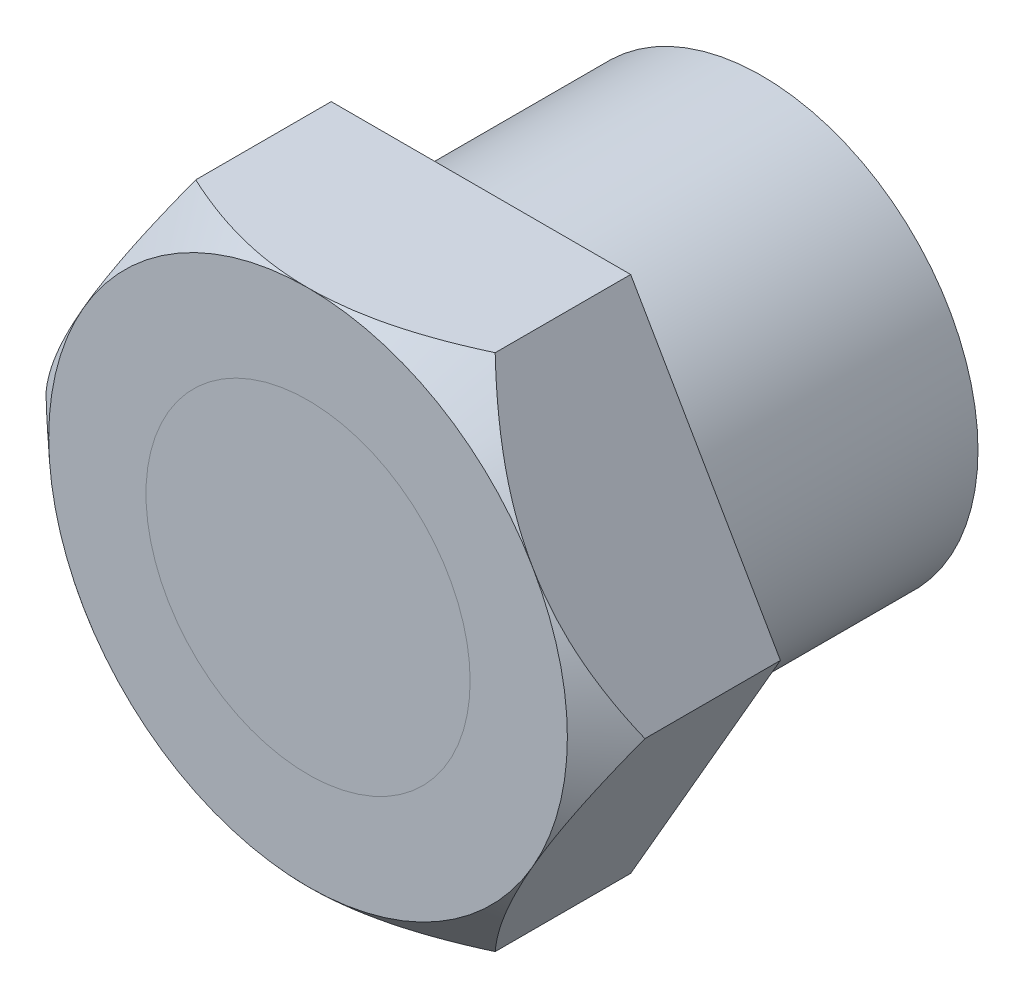
ISO-10303-21;
HEADER;
FILE_DESCRIPTION(('STEP AP214'),'2;1');
FILE_NAME('part.step','',(''),(''),'','','');
FILE_SCHEMA(('AUTOMOTIVE_DESIGN { 1 0 10303 214 1 1 1 1 }'));
ENDSEC;
DATA;
#1=APPLICATION_CONTEXT('core data for automotive mechanical design processes');
#2=APPLICATION_PROTOCOL_DEFINITION('international standard','automotive_design',2000,#1);
#3=PRODUCT_CONTEXT('',#1,'mechanical');
#4=PRODUCT('Part','Part','',(#3));
#5=PRODUCT_RELATED_PRODUCT_CATEGORY('part','',(#4));
#6=PRODUCT_DEFINITION_FORMATION('','',#4);
#7=PRODUCT_DEFINITION_CONTEXT('part definition',#1,'design');
#8=PRODUCT_DEFINITION('design','',#6,#7);
#9=PRODUCT_DEFINITION_SHAPE('','',#8);
#10=(LENGTH_UNIT() NAMED_UNIT(*) SI_UNIT(.MILLI.,.METRE.));
#11=(NAMED_UNIT(*) PLANE_ANGLE_UNIT() SI_UNIT($,.RADIAN.));
#12=(NAMED_UNIT(*) SI_UNIT($,.STERADIAN.) SOLID_ANGLE_UNIT());
#13=UNCERTAINTY_MEASURE_WITH_UNIT(LENGTH_MEASURE(1.E-05),#10,'distance_accuracy_value','');
#14=(GEOMETRIC_REPRESENTATION_CONTEXT(3) GLOBAL_UNCERTAINTY_ASSIGNED_CONTEXT((#13)) GLOBAL_UNIT_ASSIGNED_CONTEXT((#10,
#11,#12)) REPRESENTATION_CONTEXT('',''));
#15=CARTESIAN_POINT('',(0.,0.,0.));
#16=DIRECTION('',(0.,0.,1.));
#17=DIRECTION('',(1.,0.,0.));
#18=AXIS2_PLACEMENT_3D('',#15,#16,#17);
#19=CARTESIAN_POINT('',(0.,0.,18.));
#20=DIRECTION('',(0.,0.,1.));
#21=DIRECTION('',(1.,0.,0.));
#22=AXIS2_PLACEMENT_3D('',#19,#20,#21);
#23=CYLINDRICAL_SURFACE('',#22,7.5);
#24=CARTESIAN_POINT('',(0.,0.,18.));
#25=DIRECTION('',(0.,0.,1.));
#26=DIRECTION('',(1.,0.,0.));
#27=AXIS2_PLACEMENT_3D('',#24,#25,#26);
#28=CIRCLE('',#27,7.5);
#29=CARTESIAN_POINT('',(7.5,0.,18.));
#30=VERTEX_POINT('',#29);
#31=EDGE_CURVE('E13',#30,#30,#28,.T.);
#32=ORIENTED_EDGE('',*,*,#31,.T.);
#33=EDGE_LOOP('',(#32));
#34=FACE_BOUND('',#33,.T.);
#35=CARTESIAN_POINT('',(0.,0.,21.));
#36=DIRECTION('',(0.,0.,1.));
#37=DIRECTION('',(1.,0.,0.));
#38=AXIS2_PLACEMENT_3D('',#35,#36,#37);
#39=CIRCLE('',#38,7.5);
#40=CARTESIAN_POINT('',(7.5,0.,21.));
#41=VERTEX_POINT('',#40);
#42=EDGE_CURVE('E63',#41,#41,#39,.T.);
#43=ORIENTED_EDGE('',*,*,#42,.F.);
#44=EDGE_LOOP('',(#43));
#45=FACE_BOUND('',#44,.T.);
#46=ADVANCED_FACE('F60',(#34,#45),#23,.T.);
#47=CARTESIAN_POINT('',(0.,0.,18.));
#48=DIRECTION('',(0.,0.,1.));
#49=DIRECTION('',(1.,0.,0.));
#50=AXIS2_PLACEMENT_3D('',#47,#48,#49);
#51=PLANE('',#50);
#52=ORIENTED_EDGE('',*,*,#31,.F.);
#53=EDGE_LOOP('',(#52));
#54=FACE_BOUND('',#53,.T.);
#55=ADVANCED_FACE('F75',(#54),#51,.F.);
#56=CARTESIAN_POINT('',(0.,0.,21.));
#57=DIRECTION('',(0.,0.,1.));
#58=DIRECTION('',(1.,0.,0.));
#59=AXIS2_PLACEMENT_3D('',#56,#57,#58);
#60=PLANE('',#59);
#61=ORIENTED_EDGE('',*,*,#42,.T.);
#62=EDGE_LOOP('',(#61));
#63=FACE_BOUND('',#62,.T.);
#64=ADVANCED_FACE('F72',(#63),#60,.T.);
#65=CLOSED_SHELL('',(#46,#55,#64));
#66=MANIFOLD_SOLID_BREP('B2',#65);
#67=CARTESIAN_POINT('',(0.,0.,21.));
#68=DIRECTION('',(0.,0.,1.));
#69=DIRECTION('',(1.,0.,0.));
#70=AXIS2_PLACEMENT_3D('',#67,#68,#69);
#71=PLANE('',#70);
#72=CARTESIAN_POINT('',(0.,0.,21.));
#73=DIRECTION('',(0.,0.,1.));
#74=DIRECTION('',(1.,0.,0.));
#75=AXIS2_PLACEMENT_3D('',#72,#73,#74);
#76=CIRCLE('',#75,7.5);
#77=CARTESIAN_POINT('',(7.5,0.,21.));
#78=VERTEX_POINT('',#77);
#79=EDGE_CURVE('E209',#78,#78,#76,.T.);
#80=ORIENTED_EDGE('',*,*,#79,.F.);
#81=EDGE_LOOP('',(#80));
#82=FACE_BOUND('',#81,.T.);
#83=CARTESIAN_POINT('',(0.,0.,21.));
#84=DIRECTION('',(0.,0.,1.));
#85=DIRECTION('',(1.,0.,0.));
#86=AXIS2_PLACEMENT_3D('',#83,#84,#85);
#87=CIRCLE('',#86,12.);
#88=CARTESIAN_POINT('',(10.3923048454133,-6.,21.));
#89=VERTEX_POINT('',#88);
#90=CARTESIAN_POINT('',(10.3923048454133,6.,21.));
#91=VERTEX_POINT('',#90);
#92=EDGE_CURVE('E196',#89,#91,#87,.T.);
#93=ORIENTED_EDGE('',*,*,#92,.T.);
#94=CARTESIAN_POINT('',(0.,12.,21.));
#95=VERTEX_POINT('',#94);
#96=EDGE_CURVE('E351',#91,#95,#87,.T.);
#97=ORIENTED_EDGE('',*,*,#96,.T.);
#98=CARTESIAN_POINT('',(-10.3923048454133,6.,21.));
#99=VERTEX_POINT('',#98);
#100=EDGE_CURVE('E134',#95,#99,#87,.T.);
#101=ORIENTED_EDGE('',*,*,#100,.T.);
#102=CARTESIAN_POINT('',(-10.3923048454133,-6.,21.));
#103=VERTEX_POINT('',#102);
#104=EDGE_CURVE('E142',#99,#103,#87,.T.);
#105=ORIENTED_EDGE('',*,*,#104,.T.);
#106=CARTESIAN_POINT('',(0.,-12.,21.));
#107=VERTEX_POINT('',#106);
#108=EDGE_CURVE('E354',#103,#107,#87,.T.);
#109=ORIENTED_EDGE('',*,*,#108,.T.);
#110=EDGE_CURVE('E353',#107,#89,#87,.T.);
#111=ORIENTED_EDGE('',*,*,#110,.T.);
#112=EDGE_LOOP('',(#93,#97,#101,#105,#109,#111));
#113=FACE_BOUND('',#112,.T.);
#114=ADVANCED_FACE('F113',(#82,#113),#71,.T.);
#115=CARTESIAN_POINT('',(13.856406460551,0.,21.));
#116=DIRECTION('',(-0.866025403784439,-0.5,0.));
#117=DIRECTION('',(0.5,-0.866025403784439,0.));
#118=AXIS2_PLACEMENT_3D('',#115,#116,#117);
#119=PLANE('',#118);
#120=CARTESIAN_POINT('',(13.8565219306049,-0.000199999999997675,19.2687652906196));
#121=CARTESIAN_POINT('',(13.7298535468322,0.219196076406888,19.3868680077246));
#122=CARTESIAN_POINT('',(13.6022405840424,0.440228211663259,19.5010328960309));
#123=CARTESIAN_POINT('',(13.3449874157697,0.885803769519554,19.7202266885841));
#124=CARTESIAN_POINT('',(13.2153461129664,1.11034909273436,19.8252504306312));
#125=CARTESIAN_POINT('',(12.9533317516002,1.56417127893333,20.0253070055428));
#126=CARTESIAN_POINT('',(12.8209476923777,1.79346719561892,20.1202825778015));
#127=CARTESIAN_POINT('',(12.5541630837989,2.25555169235469,20.2980559822874));
#128=CARTESIAN_POINT('',(12.4197628544586,2.48833971812109,20.3808557250454));
#129=CARTESIAN_POINT('',(12.151395636061,2.95316537547157,20.5313827715993));
#130=CARTESIAN_POINT('',(12.0174623191401,3.18514468520479,20.5993487527394));
#131=CARTESIAN_POINT('',(11.7479403692396,3.65197039618762,20.7205259668705));
#132=CARTESIAN_POINT('',(11.6123519189156,3.88681648106823,20.773738812878));
#133=CARTESIAN_POINT('',(11.3401274148654,4.3583231531485,20.8639847638536));
#134=CARTESIAN_POINT('',(11.203494264481,4.59497871161238,20.9010526460722));
#135=CARTESIAN_POINT('',(10.9293403726877,5.06982718129112,20.9581367840253));
#136=CARTESIAN_POINT('',(10.7918196991394,5.30801997496793,20.9781543282349));
#137=CARTESIAN_POINT('',(10.5340151153218,5.7545506125642,20.9991179727742));
#138=CARTESIAN_POINT('',(10.4137732106192,5.96281570070792,21.002173494282));
#139=CARTESIAN_POINT('',(10.1733955843862,6.37916196234616,20.9947973649588));
#140=CARTESIAN_POINT('',(10.053259859518,6.5872431416221,20.9843661543718));
#141=CARTESIAN_POINT('',(9.81338228458328,7.00272328900542,20.9502462596401));
#142=CARTESIAN_POINT('',(9.69364075382888,7.21012170404811,20.9265486621989));
#143=CARTESIAN_POINT('',(9.45496344405281,7.62352293119413,20.866418130283));
#144=CARTESIAN_POINT('',(9.33602767716845,7.82952572227501,20.8299850044043));
#145=CARTESIAN_POINT('',(9.0991635038578,8.23978650494185,20.7451096847123));
#146=CARTESIAN_POINT('',(8.98123574219604,8.44404337976288,20.6966603242633));
#147=CARTESIAN_POINT('',(8.7466504656097,8.85035699751804,20.5886664235882));
#148=CARTESIAN_POINT('',(8.62999316321666,9.05241337233669,20.5291200562592));
#149=CARTESIAN_POINT('',(8.28224284580934,9.65473459043438,20.3353579119844));
#150=CARTESIAN_POINT('',(8.05323546599603,10.0513870075793,20.1859683094035));
#151=CARTESIAN_POINT('',(7.6744163249995,10.7075210066649,19.9082662379181));
#152=CARTESIAN_POINT('',(7.52293912428992,10.9698872144822,19.7887563472591));
#153=CARTESIAN_POINT('',(7.22326061381493,11.4889456205614,19.5374819210416));
#154=CARTESIAN_POINT('',(7.07504852250161,11.7456564930121,19.405768969276));
#155=CARTESIAN_POINT('',(6.92808776022167,12.0002,19.2687652906196));
#156=B_SPLINE_CURVE_WITH_KNOTS('',3,(#120,#121,#122,#123,#124,#125,#126,#127,#128,#129,#130,
#131,#132,#133,#134,#135,#136,#137,#138,#139,#140,#141,#142,#143,#144,#145,#146,#147,#148,#149,
#150,#151,#152,#153,#154,#155),.UNSPECIFIED.,.F.,.F.,(4,2,2,2,2,2,2,2,2,2,2,2,2,2,2,2,2,4),(0.,
0.838578409162805,1.6776273497624,2.52122579459731,3.36469172733357,4.19337849948459,
5.02197463239258,5.84877698290693,6.67551684733856,7.39665658074843,8.1177727747686,
8.83937404809948,9.56098616693492,10.2830297037767,11.0051922290314,12.4486904571501,
13.425463991688,14.3982821681343),.UNSPECIFIED.);
#157=CARTESIAN_POINT('',(13.856406460551,0.,19.2688729695328));
#158=VERTEX_POINT('',#157);
#159=EDGE_CURVE('E193',#158,#91,#156,.T.);
#160=ORIENTED_EDGE('',*,*,#159,.F.);
#161=DIRECTION('',(0.,0.,-1.));
#162=VECTOR('',#161,1.);
#163=CARTESIAN_POINT('',(13.856406460551,0.,21.));
#164=LINE('',#163,#162);
#165=CARTESIAN_POINT('',(13.856406460551,0.,13.));
#166=VERTEX_POINT('',#165);
#167=EDGE_CURVE('E205',#158,#166,#164,.T.);
#168=ORIENTED_EDGE('',*,*,#167,.T.);
#169=DIRECTION('',(-0.5,0.866025403784439,0.));
#170=VECTOR('',#169,1.);
#171=CARTESIAN_POINT('',(13.856406460551,0.,13.));
#172=LINE('',#171,#170);
#173=CARTESIAN_POINT('',(6.92820323027551,12.,13.));
#174=VERTEX_POINT('',#173);
#175=EDGE_CURVE('E252',#166,#174,#172,.T.);
#176=ORIENTED_EDGE('',*,*,#175,.T.);
#177=DIRECTION('',(0.,0.,-1.));
#178=VECTOR('',#177,1.);
#179=CARTESIAN_POINT('',(6.92820323027551,12.,21.));
#180=LINE('',#179,#178);
#181=CARTESIAN_POINT('',(6.92820323027551,12.,19.2688729695328));
#182=VERTEX_POINT('',#181);
#183=EDGE_CURVE('E228',#182,#174,#180,.T.);
#184=ORIENTED_EDGE('',*,*,#183,.F.);
#185=EDGE_CURVE('E208',#91,#182,#156,.T.);
#186=ORIENTED_EDGE('',*,*,#185,.F.);
#187=EDGE_LOOP('',(#160,#168,#176,#184,#186));
#188=FACE_BOUND('',#187,.T.);
#189=ADVANCED_FACE('F203',(#188),#119,.F.);
#190=CARTESIAN_POINT('',(6.92820323027551,12.,21.));
#191=DIRECTION('',(0.,-1.,0.));
#192=DIRECTION('',(0.,0.,-1.));
#193=AXIS2_PLACEMENT_3D('',#190,#191,#192);
#194=PLANE('',#193);
#195=CARTESIAN_POINT('',(20.9284032302755,12.,9.69359402309739));
#196=CARTESIAN_POINT('',(20.5961115460008,12.,9.96239392915399));
#197=CARTESIAN_POINT('',(20.2630559804058,12.,10.2302535766126));
#198=CARTESIAN_POINT('',(19.5951954040262,12.,10.7637960719106));
#199=CARTESIAN_POINT('',(19.2603903583496,12.,11.0294788760609));
#200=CARTESIAN_POINT('',(18.5886148407881,12.,11.5585240963392));
#201=CARTESIAN_POINT('',(18.2516431581626,12.,11.821884976426));
#202=CARTESIAN_POINT('',(17.5754801520445,12.,12.3457410933049));
#203=CARTESIAN_POINT('',(17.2362888370438,12.,12.6062363410501));
#204=CARTESIAN_POINT('',(16.5409377948354,12.,13.1348934115765));
#205=CARTESIAN_POINT('',(16.184668726395,12.,13.4029115798384));
#206=CARTESIAN_POINT('',(15.4689875048341,12.,13.9347168007166));
#207=CARTESIAN_POINT('',(15.1095753794347,12.,14.1985038905922));
#208=CARTESIAN_POINT('',(14.3872367228909,12.,14.720994251888));
#209=CARTESIAN_POINT('',(14.0243113024537,12.,14.9796990564253));
#210=CARTESIAN_POINT('',(13.2942712257131,12.,15.4911401735357));
#211=CARTESIAN_POINT('',(12.9271565716275,12.,15.7438764892684));
#212=CARTESIAN_POINT('',(12.1872161218997,12.,16.2427352918662));
#213=CARTESIAN_POINT('',(11.8143791043053,12.,16.4888411750683));
#214=CARTESIAN_POINT('',(11.0630280534424,12.,16.9722713284048));
#215=CARTESIAN_POINT('',(10.6845139265705,12.,17.2095954535226));
#216=CARTESIAN_POINT('',(9.92041477173562,12.,17.6737491871757));
#217=CARTESIAN_POINT('',(9.53482130896823,12.,17.90056496624));
#218=CARTESIAN_POINT('',(8.75602168983686,12.,18.3407787062768));
#219=CARTESIAN_POINT('',(8.36281573513831,12.,18.5541770220619));
#220=CARTESIAN_POINT('',(7.57496809999253,12.,18.9604769232341));
#221=CARTESIAN_POINT('',(7.18048374047764,12.,19.1536816251151));
#222=CARTESIAN_POINT('',(6.38211904633376,12.,19.5199574784065));
#223=CARTESIAN_POINT('',(5.97823733514981,12.,19.6930256575877));
#224=CARTESIAN_POINT('',(5.16151587272158,12.,20.0136480238708));
#225=CARTESIAN_POINT('',(4.74870036434969,12.,20.1612633911765));
#226=CARTESIAN_POINT('',(3.91335709466702,12.,20.425683616891));
#227=CARTESIAN_POINT('',(3.49083492565155,12.,20.542505755095));
#228=CARTESIAN_POINT('',(2.85044334445482,12.,20.6902590635561));
#229=CARTESIAN_POINT('',(2.63570358440288,12.,20.7349549222836));
#230=CARTESIAN_POINT('',(2.20441212230094,12.,20.8144606857338));
#231=CARTESIAN_POINT('',(1.98786066773702,12.,20.8492719187553));
#232=CARTESIAN_POINT('',(1.55333063804168,12.,20.9084195363158));
#233=CARTESIAN_POINT('',(1.33535208477349,12.,20.9327560809484));
#234=CARTESIAN_POINT('',(0.898443369969175,12.,20.9705133124553));
#235=CARTESIAN_POINT('',(0.679513198166485,12.,20.983933881267));
#236=CARTESIAN_POINT('',(0.241682864132701,12.,20.9995860580908));
#237=CARTESIAN_POINT('',(0.0227834920595544,12.,21.0018396513316));
#238=CARTESIAN_POINT('',(-0.414842670827201,12.,20.9951743548103));
#239=CARTESIAN_POINT('',(-0.633569462148983,12.,20.9862554980697));
#240=CARTESIAN_POINT('',(-1.07030719133705,12.,20.9574138569585));
#241=CARTESIAN_POINT('',(-1.28831809132203,12.,20.9374904994323));
#242=CARTESIAN_POINT('',(-1.72311616367707,12.,20.8870156161981));
#243=CARTESIAN_POINT('',(-1.93990316590208,12.,20.8564626480297));
#244=CARTESIAN_POINT('',(-2.58126666821559,12.,20.7506900597248));
#245=CARTESIAN_POINT('',(-3.00349910407713,12.,20.6608859275909));
#246=CARTESIAN_POINT('',(-3.83908124539416,12.,20.4472752374638));
#247=CARTESIAN_POINT('',(-4.25243015253451,12.,20.3234656372437));
#248=CARTESIAN_POINT('',(-5.07458075569307,12.,20.0458894741855));
#249=CARTESIAN_POINT('',(-5.48326239510589,12.,19.8917702737064));
#250=CARTESIAN_POINT('',(-6.08889663483739,12.,19.6430235284429));
#251=CARTESIAN_POINT('',(-6.28953512992941,12.,19.5571839027856));
#252=CARTESIAN_POINT('',(-6.68847574237759,12.,19.3802296034082));
#253=CARTESIAN_POINT('',(-6.88677786853252,12.,19.2891149495615));
#254=CARTESIAN_POINT('',(-7.4124488125856,12.,19.0399223033906));
#255=CARTESIAN_POINT('',(-7.73783313867491,12.,18.8776550615308));
#256=CARTESIAN_POINT('',(-8.38295561387836,12.,18.5422164939008));
#257=CARTESIAN_POINT('',(-8.70269292898019,12.,18.3690435744222));
#258=CARTESIAN_POINT('',(-9.337241570953,12.,18.0135063446248));
#259=CARTESIAN_POINT('',(-9.65204996156143,12.,17.8311368097286));
#260=CARTESIAN_POINT('',(-10.2770942456345,12.,17.4587779809308));
#261=CARTESIAN_POINT('',(-10.5873303432614,12.,17.2687890286698));
#262=CARTESIAN_POINT('',(-11.2048047944886,12.,16.8817242847492));
#263=CARTESIAN_POINT('',(-11.5120294378762,12.,16.6846266718658));
#264=CARTESIAN_POINT('',(-12.1228876969323,12.,16.2849325041117));
#265=CARTESIAN_POINT('',(-12.4265211951099,12.,16.0823357700376));
#266=CARTESIAN_POINT('',(-13.0305076248845,12.,15.6725188154481));
#267=CARTESIAN_POINT('',(-13.3308615576271,12.,15.465300068197));
#268=CARTESIAN_POINT('',(-13.9287509845576,12.,15.0468320024675));
#269=CARTESIAN_POINT('',(-14.2262864316245,12.,14.8355826167803));
#270=CARTESIAN_POINT('',(-15.0717040210684,12.,14.2278583798228));
#271=CARTESIAN_POINT('',(-15.616549123649,12.,13.8271566929274));
#272=CARTESIAN_POINT('',(-16.6993618881535,12.,13.0165123416076));
#273=CARTESIAN_POINT('',(-17.2373289760055,12.,12.6065689136125));
#274=CARTESIAN_POINT('',(-18.303430196658,12.,11.7826408871182));
#275=CARTESIAN_POINT('',(-18.831608355231,12.,11.3687131828644));
#276=CARTESIAN_POINT('',(-19.6203938727146,12.,10.7435354390202));
#277=CARTESIAN_POINT('',(-19.8827194719618,12.,10.5344468288548));
#278=CARTESIAN_POINT('',(-20.4063223229468,12.,10.1149654229555));
#279=CARTESIAN_POINT('',(-20.667599583651,12.,9.90457263841559));
#280=CARTESIAN_POINT('',(-20.9284032302755,12.,9.69359402309739));
#281=B_SPLINE_CURVE_WITH_KNOTS('',3,(#195,#196,#197,#198,#199,#200,#201,#202,#203,#204,#205,
#206,#207,#208,#209,#210,#211,#212,#213,#214,#215,#216,#217,#218,#219,#220,#221,#222,#223,#224,
#225,#226,#227,#228,#229,#230,#231,#232,#233,#234,#235,#236,#237,#238,#239,#240,#241,#242,#243,
#244,#245,#246,#247,#248,#249,#250,#251,#252,#253,#254,#255,#256,#257,#258,#259,#260,#261,#262,
#263,#264,#265,#266,#267,#268,#269,#270,#271,#272,#273,#274,#275,#276,#277,#278,#279,#280),
.UNSPECIFIED.,.F.,.F.,(4,2,2,2,2,2,2,2,2,2,2,2,2,2,2,2,2,2,2,2,2,2,2,2,2,2,2,2,2,2,2,2,2,2,2,2,
2,2,2,2,2,2,4),(0.,1.28220344662964,2.5644325641958,3.84745437564654,5.13047128138408,
6.46792449974251,7.80536593390215,9.14239752176667,10.4794284017941,11.8195438866476,
13.1596814914783,14.5015353968087,15.8433538030859,17.1606707019033,18.4781817958172,
19.7924804889265,21.1060400781413,21.7638736632825,22.4216188066809,23.0793538968511,
23.7370961007135,24.393542844218,25.0499876475111,25.7064666441338,26.3630347611041,
27.656242399545,28.94956576976,30.2589363684924,30.9135670585536,31.5681952824888,
32.6587322758378,33.7494290070065,34.8407524985866,35.9320271118111,37.0269974220881,
38.1220034578042,39.2166653126068,40.3113454363444,42.3401845697403,44.3691919485964,
46.3822891867395,47.3886631063973,48.395028400121),.UNSPECIFIED.);
#282=EDGE_CURVE('E287',#182,#95,#281,.T.);
#283=ORIENTED_EDGE('',*,*,#282,.F.);
#284=ORIENTED_EDGE('',*,*,#183,.T.);
#285=DIRECTION('',(-1.,0.,0.));
#286=VECTOR('',#285,1.);
#287=CARTESIAN_POINT('',(6.92820323027551,12.,13.));
#288=LINE('',#287,#286);
#289=CARTESIAN_POINT('',(-6.92820323027551,12.,13.));
#290=VERTEX_POINT('',#289);
#291=EDGE_CURVE('E254',#174,#290,#288,.T.);
#292=ORIENTED_EDGE('',*,*,#291,.T.);
#293=DIRECTION('',(0.,0.,-1.));
#294=VECTOR('',#293,1.);
#295=CARTESIAN_POINT('',(-6.92820323027551,12.,21.));
#296=LINE('',#295,#294);
#297=CARTESIAN_POINT('',(-6.92820323027551,12.,19.2688729695328));
#298=VERTEX_POINT('',#297);
#299=EDGE_CURVE('E226',#298,#290,#296,.T.);
#300=ORIENTED_EDGE('',*,*,#299,.F.);
#301=EDGE_CURVE('E288',#95,#298,#281,.T.);
#302=ORIENTED_EDGE('',*,*,#301,.F.);
#303=EDGE_LOOP('',(#283,#284,#292,#300,#302));
#304=FACE_BOUND('',#303,.T.);
#305=ADVANCED_FACE('F284',(#304),#194,.F.);
#306=CARTESIAN_POINT('',(-6.92820323027551,12.,21.));
#307=DIRECTION('',(0.866025403784439,-0.5,0.));
#308=DIRECTION('',(0.5,0.866025403784439,0.));
#309=AXIS2_PLACEMENT_3D('',#306,#307,#308);
#310=PLANE('',#309);
#311=CARTESIAN_POINT('',(-6.92808776022167,12.0002,19.2687652906196));
#312=CARTESIAN_POINT('',(-7.05475614399434,11.7808039235931,19.3868680077245));
#313=CARTESIAN_POINT('',(-7.18236910678416,11.5597717883367,19.5010328960309));
#314=CARTESIAN_POINT('',(-7.43962227505681,11.1141962304804,19.7202266885841));
#315=CARTESIAN_POINT('',(-7.56926357786015,10.8896509072656,19.8252504306312));
#316=CARTESIAN_POINT('',(-7.83127793922635,10.4358287210667,20.0253070055428));
#317=CARTESIAN_POINT('',(-7.96366199844886,10.2065328043811,20.1202825778015));
#318=CARTESIAN_POINT('',(-8.23044660702761,9.74444830764531,20.2980559822874));
#319=CARTESIAN_POINT('',(-8.36484683636796,9.51166028187892,20.3808557250454));
#320=CARTESIAN_POINT('',(-8.63321405476551,9.04683462452843,20.5313827715993));
#321=CARTESIAN_POINT('',(-8.7671473716864,8.81485531479522,20.5993487527394));
#322=CARTESIAN_POINT('',(-9.03666932158698,8.34802960381238,20.7205259668705));
#323=CARTESIAN_POINT('',(-9.17225777191093,8.11318351893178,20.773738812878));
#324=CARTESIAN_POINT('',(-9.44448227596118,7.6416768468515,20.8639847638536));
#325=CARTESIAN_POINT('',(-9.58111542634552,7.40502128838762,20.9010526460722));
#326=CARTESIAN_POINT('',(-9.85526931813883,6.93017281870888,20.9581367840253));
#327=CARTESIAN_POINT('',(-9.99278999168716,6.69198002503207,20.9781543282349));
#328=CARTESIAN_POINT('',(-10.2505945755048,6.2454493874358,20.9991179727742));
#329=CARTESIAN_POINT('',(-10.3708364802074,6.03718429929208,21.002173494282));
#330=CARTESIAN_POINT('',(-10.6112141064403,5.62083803765385,20.9947973649588));
#331=CARTESIAN_POINT('',(-10.7313498313085,5.41275685837791,20.9843661543718));
#332=CARTESIAN_POINT('',(-10.9712274062433,4.99727671099458,20.95024625964));
#333=CARTESIAN_POINT('',(-11.0909689369977,4.78987829595189,20.9265486621989));
#334=CARTESIAN_POINT('',(-11.3296462467737,4.37647706880587,20.866418130283));
#335=CARTESIAN_POINT('',(-11.4485820136581,4.170474277725,20.8299850044043));
#336=CARTESIAN_POINT('',(-11.6854461869687,3.76021349505816,20.7451096847123));
#337=CARTESIAN_POINT('',(-11.8033739486305,3.55595662023712,20.6966603242633));
#338=CARTESIAN_POINT('',(-12.0379592252168,3.14964300248197,20.5886664235882));
#339=CARTESIAN_POINT('',(-12.1546165276099,2.94758662766331,20.5291200562592));
#340=CARTESIAN_POINT('',(-12.5023668450172,2.34526540956563,20.3353579119844));
#341=CARTESIAN_POINT('',(-12.7313742248305,1.94861299242075,20.1859683094035));
#342=CARTESIAN_POINT('',(-13.110193365827,1.29247899333515,19.9082662379181));
#343=CARTESIAN_POINT('',(-13.2616705665366,1.03011278551785,19.7887563472591));
#344=CARTESIAN_POINT('',(-13.5613490770116,0.511054379438619,19.5374819210416));
#345=CARTESIAN_POINT('',(-13.7095611683249,0.254343506987906,19.405768969276));
#346=CARTESIAN_POINT('',(-13.8565219306049,-0.00019999999999656,19.2687652906196));
#347=B_SPLINE_CURVE_WITH_KNOTS('',3,(#311,#312,#313,#314,#315,#316,#317,#318,#319,#320,#321,
#322,#323,#324,#325,#326,#327,#328,#329,#330,#331,#332,#333,#334,#335,#336,#337,#338,#339,#340,
#341,#342,#343,#344,#345,#346),.UNSPECIFIED.,.F.,.F.,(4,2,2,2,2,2,2,2,2,2,2,2,2,2,2,2,2,4),(0.,
0.838578409162805,1.6776273497624,2.52122579459731,3.36469172733357,4.19337849948459,
5.02197463239258,5.84877698290694,6.67551684733857,7.39665658074843,8.11777277476861,
8.83937404809949,9.56098616693492,10.2830297037767,11.0051922290314,12.4486904571501,
13.425463991688,14.3982821681343),.UNSPECIFIED.);
#348=EDGE_CURVE('E291',#298,#99,#347,.T.);
#349=ORIENTED_EDGE('',*,*,#348,.F.);
#350=ORIENTED_EDGE('',*,*,#299,.T.);
#351=DIRECTION('',(-0.5,-0.866025403784439,0.));
#352=VECTOR('',#351,1.);
#353=CARTESIAN_POINT('',(-6.92820323027551,12.,13.));
#354=LINE('',#353,#352);
#355=CARTESIAN_POINT('',(-13.856406460551,0.,13.));
#356=VERTEX_POINT('',#355);
#357=EDGE_CURVE('E265',#290,#356,#354,.T.);
#358=ORIENTED_EDGE('',*,*,#357,.T.);
#359=DIRECTION('',(0.,0.,-1.));
#360=VECTOR('',#359,1.);
#361=CARTESIAN_POINT('',(-13.856406460551,0.,21.));
#362=LINE('',#361,#360);
#363=CARTESIAN_POINT('',(-13.856406460551,0.,19.2688729695328));
#364=VERTEX_POINT('',#363);
#365=EDGE_CURVE('E224',#364,#356,#362,.T.);
#366=ORIENTED_EDGE('',*,*,#365,.F.);
#367=EDGE_CURVE('E298',#99,#364,#347,.T.);
#368=ORIENTED_EDGE('',*,*,#367,.F.);
#369=EDGE_LOOP('',(#349,#350,#358,#366,#368));
#370=FACE_BOUND('',#369,.T.);
#371=ADVANCED_FACE('F336',(#370),#310,.F.);
#372=CARTESIAN_POINT('',(-13.856406460551,0.,21.));
#373=DIRECTION('',(0.866025403784439,0.5,0.));
#374=DIRECTION('',(-0.5,0.866025403784438,0.));
#375=AXIS2_PLACEMENT_3D('',#372,#373,#374);
#376=PLANE('',#375);
#377=CARTESIAN_POINT('',(-13.8565219306049,0.00020000000000334,19.2687652906196));
#378=CARTESIAN_POINT('',(-13.7298535468322,-0.219196076406883,19.3868680077246));
#379=CARTESIAN_POINT('',(-13.6022405840424,-0.440228211663255,19.5010328960309));
#380=CARTESIAN_POINT('',(-13.3449874157697,-0.88580376951955,19.7202266885841));
#381=CARTESIAN_POINT('',(-13.2153461129664,-1.11034909273436,19.8252504306312));
#382=CARTESIAN_POINT('',(-12.9533317516002,-1.56417127893332,20.0253070055428));
#383=CARTESIAN_POINT('',(-12.8209476923777,-1.79346719561892,20.1202825778015));
#384=CARTESIAN_POINT('',(-12.5541630837989,-2.25555169235469,20.2980559822874));
#385=CARTESIAN_POINT('',(-12.4197628544586,-2.48833971812109,20.3808557250454));
#386=CARTESIAN_POINT('',(-12.151395636061,-2.95316537547157,20.5313827715993));
#387=CARTESIAN_POINT('',(-12.0174623191401,-3.18514468520479,20.5993487527394));
#388=CARTESIAN_POINT('',(-11.7479403692396,-3.65197039618762,20.7205259668705));
#389=CARTESIAN_POINT('',(-11.6123519189156,-3.88681648106823,20.773738812878));
#390=CARTESIAN_POINT('',(-11.3401274148654,-4.3583231531485,20.8639847638536));
#391=CARTESIAN_POINT('',(-11.203494264481,-4.59497871161238,20.9010526460722));
#392=CARTESIAN_POINT('',(-10.9293403726877,-5.06982718129113,20.9581367840253));
#393=CARTESIAN_POINT('',(-10.7918196991394,-5.30801997496793,20.978154328235));
#394=CARTESIAN_POINT('',(-10.5340151153218,-5.7545506125642,20.9991179727742));
#395=CARTESIAN_POINT('',(-10.4137732106192,-5.96281570070792,21.002173494282));
#396=CARTESIAN_POINT('',(-10.1733955843862,-6.37916196234616,20.9947973649588));
#397=CARTESIAN_POINT('',(-10.053259859518,-6.5872431416221,20.9843661543718));
#398=CARTESIAN_POINT('',(-9.81338228458327,-7.00272328900543,20.9502462596401));
#399=CARTESIAN_POINT('',(-9.69364075382888,-7.21012170404811,20.9265486621989));
#400=CARTESIAN_POINT('',(-9.4549634440528,-7.62352293119413,20.866418130283));
#401=CARTESIAN_POINT('',(-9.33602767716844,-7.82952572227501,20.8299850044043));
#402=CARTESIAN_POINT('',(-9.0991635038578,-8.23978650494185,20.7451096847123));
#403=CARTESIAN_POINT('',(-8.98123574219604,-8.44404337976288,20.6966603242633));
#404=CARTESIAN_POINT('',(-8.74665046560969,-8.85035699751804,20.5886664235882));
#405=CARTESIAN_POINT('',(-8.62999316321666,-9.05241337233669,20.5291200562592));
#406=CARTESIAN_POINT('',(-8.28224284580934,-9.65473459043438,20.3353579119844));
#407=CARTESIAN_POINT('',(-8.05323546599602,-10.0513870075793,20.1859683094035));
#408=CARTESIAN_POINT('',(-7.67441632499949,-10.7075210066648,19.9082662379181));
#409=CARTESIAN_POINT('',(-7.52293912428991,-10.9698872144822,19.7887563472591));
#410=CARTESIAN_POINT('',(-7.22326061381493,-11.4889456205614,19.5374819210416));
#411=CARTESIAN_POINT('',(-7.07504852250161,-11.7456564930121,19.405768969276));
#412=CARTESIAN_POINT('',(-6.92808776022167,-12.0002,19.2687652906196));
#413=B_SPLINE_CURVE_WITH_KNOTS('',3,(#377,#378,#379,#380,#381,#382,#383,#384,#385,#386,#387,
#388,#389,#390,#391,#392,#393,#394,#395,#396,#397,#398,#399,#400,#401,#402,#403,#404,#405,#406,
#407,#408,#409,#410,#411,#412),.UNSPECIFIED.,.F.,.F.,(4,2,2,2,2,2,2,2,2,2,2,2,2,2,2,2,2,4),(0.,
0.838578409162806,1.6776273497624,2.52122579459731,3.36469172733357,4.1933784994846,
5.02197463239259,5.84877698290694,6.67551684733858,7.39665658074844,8.11777277476862,
8.83937404809949,9.56098616693493,10.2830297037767,11.0051922290314,12.4486904571501,
13.425463991688,14.3982821681343),.UNSPECIFIED.);
#414=EDGE_CURVE('E331',#364,#103,#413,.T.);
#415=ORIENTED_EDGE('',*,*,#414,.F.);
#416=ORIENTED_EDGE('',*,*,#365,.T.);
#417=DIRECTION('',(0.5,-0.866025403784438,0.));
#418=VECTOR('',#417,1.);
#419=CARTESIAN_POINT('',(-13.856406460551,0.,13.));
#420=LINE('',#419,#418);
#421=CARTESIAN_POINT('',(-6.92820323027551,-12.,13.));
#422=VERTEX_POINT('',#421);
#423=EDGE_CURVE('E268',#356,#422,#420,.T.);
#424=ORIENTED_EDGE('',*,*,#423,.T.);
#425=DIRECTION('',(0.,0.,-1.));
#426=VECTOR('',#425,1.);
#427=CARTESIAN_POINT('',(-6.92820323027551,-12.,21.));
#428=LINE('',#427,#426);
#429=CARTESIAN_POINT('',(-6.92820323027551,-12.,19.2688729695328));
#430=VERTEX_POINT('',#429);
#431=EDGE_CURVE('E217',#430,#422,#428,.T.);
#432=ORIENTED_EDGE('',*,*,#431,.F.);
#433=EDGE_CURVE('E325',#103,#430,#413,.T.);
#434=ORIENTED_EDGE('',*,*,#433,.F.);
#435=EDGE_LOOP('',(#415,#416,#424,#432,#434));
#436=FACE_BOUND('',#435,.T.);
#437=ADVANCED_FACE('F333',(#436),#376,.F.);
#438=CARTESIAN_POINT('',(-6.92820323027551,-12.,21.));
#439=DIRECTION('',(0.,1.,0.));
#440=DIRECTION('',(0.,0.,1.));
#441=AXIS2_PLACEMENT_3D('',#438,#439,#440);
#442=PLANE('',#441);
#443=CARTESIAN_POINT('',(-20.9284032302755,-12.,9.6935940230974));
#444=CARTESIAN_POINT('',(-20.5961115460008,-12.,9.962393929154));
#445=CARTESIAN_POINT('',(-20.2630559804058,-12.,10.2302535766126));
#446=CARTESIAN_POINT('',(-19.5951954040262,-12.,10.7637960719106));
#447=CARTESIAN_POINT('',(-19.2603903583496,-12.,11.0294788760609));
#448=CARTESIAN_POINT('',(-18.5886148407881,-12.,11.5585240963392));
#449=CARTESIAN_POINT('',(-18.2516431581626,-12.,11.821884976426));
#450=CARTESIAN_POINT('',(-17.5754801520445,-12.,12.3457410933049));
#451=CARTESIAN_POINT('',(-17.2362888370438,-12.,12.6062363410501));
#452=CARTESIAN_POINT('',(-16.5409377948354,-12.,13.1348934115765));
#453=CARTESIAN_POINT('',(-16.184668726395,-12.,13.4029115798384));
#454=CARTESIAN_POINT('',(-15.4689875048341,-12.,13.9347168007166));
#455=CARTESIAN_POINT('',(-15.1095753794347,-12.,14.1985038905922));
#456=CARTESIAN_POINT('',(-14.3872367228909,-12.,14.720994251888));
#457=CARTESIAN_POINT('',(-14.0243113024537,-12.,14.9796990564253));
#458=CARTESIAN_POINT('',(-13.2942712257131,-12.,15.4911401735357));
#459=CARTESIAN_POINT('',(-12.9271565716275,-12.,15.7438764892684));
#460=CARTESIAN_POINT('',(-12.1872161218997,-12.,16.2427352918662));
#461=CARTESIAN_POINT('',(-11.8143791043053,-12.,16.4888411750683));
#462=CARTESIAN_POINT('',(-11.0630280534424,-12.,16.9722713284048));
#463=CARTESIAN_POINT('',(-10.6845139265705,-12.,17.2095954535226));
#464=CARTESIAN_POINT('',(-9.92041477173562,-12.,17.6737491871757));
#465=CARTESIAN_POINT('',(-9.53482130896822,-12.,17.9005649662401));
#466=CARTESIAN_POINT('',(-8.75602168983685,-12.,18.3407787062768));
#467=CARTESIAN_POINT('',(-8.36281573513831,-12.,18.5541770220619));
#468=CARTESIAN_POINT('',(-7.57496809999253,-12.,18.9604769232341));
#469=CARTESIAN_POINT('',(-7.18048374047763,-12.,19.1536816251151));
#470=CARTESIAN_POINT('',(-6.38211904633376,-12.,19.5199574784065));
#471=CARTESIAN_POINT('',(-5.97823733514981,-12.,19.6930256575877));
#472=CARTESIAN_POINT('',(-5.16151587272158,-12.,20.0136480238708));
#473=CARTESIAN_POINT('',(-4.74870036434969,-12.,20.1612633911765));
#474=CARTESIAN_POINT('',(-3.91335709466702,-12.,20.425683616891));
#475=CARTESIAN_POINT('',(-3.49083492565155,-12.,20.542505755095));
#476=CARTESIAN_POINT('',(-2.85044334445482,-12.,20.6902590635561));
#477=CARTESIAN_POINT('',(-2.63570358440288,-12.,20.7349549222836));
#478=CARTESIAN_POINT('',(-2.20441212230094,-12.,20.8144606857338));
#479=CARTESIAN_POINT('',(-1.98786066773703,-12.,20.8492719187553));
#480=CARTESIAN_POINT('',(-1.55333063804168,-12.,20.9084195363158));
#481=CARTESIAN_POINT('',(-1.33535208477349,-12.,20.9327560809484));
#482=CARTESIAN_POINT('',(-0.898443369969177,-12.,20.9705133124553));
#483=CARTESIAN_POINT('',(-0.679513198166487,-12.,20.983933881267));
#484=CARTESIAN_POINT('',(-0.241682864132703,-12.,20.9995860580908));
#485=CARTESIAN_POINT('',(-0.0227834920595577,-12.,21.0018396513316));
#486=CARTESIAN_POINT('',(0.414842670827196,-12.,20.9951743548103));
#487=CARTESIAN_POINT('',(0.633569462148978,-12.,20.9862554980697));
#488=CARTESIAN_POINT('',(1.07030719133704,-12.,20.9574138569585));
#489=CARTESIAN_POINT('',(1.28831809132202,-12.,20.9374904994323));
#490=CARTESIAN_POINT('',(1.72311616367706,-12.,20.8870156161981));
#491=CARTESIAN_POINT('',(1.93990316590208,-12.,20.8564626480297));
#492=CARTESIAN_POINT('',(2.58126666821559,-12.,20.7506900597248));
#493=CARTESIAN_POINT('',(3.00349910407712,-12.,20.6608859275909));
#494=CARTESIAN_POINT('',(3.83908124539415,-12.,20.4472752374638));
#495=CARTESIAN_POINT('',(4.2524301525345,-12.,20.3234656372437));
#496=CARTESIAN_POINT('',(5.07458075569307,-12.,20.0458894741855));
#497=CARTESIAN_POINT('',(5.48326239510588,-12.,19.8917702737064));
#498=CARTESIAN_POINT('',(6.08889663483738,-12.,19.6430235284429));
#499=CARTESIAN_POINT('',(6.2895351299294,-12.,19.5571839027856));
#500=CARTESIAN_POINT('',(6.68847574237759,-12.,19.3802296034082));
#501=CARTESIAN_POINT('',(6.88677786853251,-12.,19.2891149495615));
#502=CARTESIAN_POINT('',(7.41244881258559,-12.,19.0399223033906));
#503=CARTESIAN_POINT('',(7.7378331386749,-12.,18.8776550615308));
#504=CARTESIAN_POINT('',(8.38295561387835,-12.,18.5422164939008));
#505=CARTESIAN_POINT('',(8.70269292898018,-12.,18.3690435744222));
#506=CARTESIAN_POINT('',(9.33724157095299,-12.,18.0135063446248));
#507=CARTESIAN_POINT('',(9.65204996156142,-12.,17.8311368097286));
#508=CARTESIAN_POINT('',(10.2770942456345,-12.,17.4587779809308));
#509=CARTESIAN_POINT('',(10.5873303432614,-12.,17.2687890286698));
#510=CARTESIAN_POINT('',(11.2048047944886,-12.,16.8817242847492));
#511=CARTESIAN_POINT('',(11.5120294378761,-12.,16.6846266718658));
#512=CARTESIAN_POINT('',(12.1228876969323,-12.,16.2849325041117));
#513=CARTESIAN_POINT('',(12.4265211951099,-12.,16.0823357700376));
#514=CARTESIAN_POINT('',(13.0305076248845,-12.,15.6725188154481));
#515=CARTESIAN_POINT('',(13.3308615576271,-12.,15.465300068197));
#516=CARTESIAN_POINT('',(13.9287509845576,-12.,15.0468320024675));
#517=CARTESIAN_POINT('',(14.2262864316245,-12.,14.8355826167803));
#518=CARTESIAN_POINT('',(15.0717040210684,-12.,14.2278583798228));
#519=CARTESIAN_POINT('',(15.616549123649,-12.,13.8271566929275));
#520=CARTESIAN_POINT('',(16.6993618881535,-12.,13.0165123416076));
#521=CARTESIAN_POINT('',(17.2373289760055,-12.,12.6065689136125));
#522=CARTESIAN_POINT('',(18.303430196658,-12.,11.7826408871182));
#523=CARTESIAN_POINT('',(18.831608355231,-12.,11.3687131828644));
#524=CARTESIAN_POINT('',(19.6203938727146,-12.,10.7435354390202));
#525=CARTESIAN_POINT('',(19.8827194719618,-12.,10.5344468288548));
#526=CARTESIAN_POINT('',(20.4063223229468,-12.,10.1149654229555));
#527=CARTESIAN_POINT('',(20.667599583651,-12.,9.9045726384156));
#528=CARTESIAN_POINT('',(20.9284032302755,-12.,9.6935940230974));
#529=B_SPLINE_CURVE_WITH_KNOTS('',3,(#443,#444,#445,#446,#447,#448,#449,#450,#451,#452,#453,
#454,#455,#456,#457,#458,#459,#460,#461,#462,#463,#464,#465,#466,#467,#468,#469,#470,#471,#472,
#473,#474,#475,#476,#477,#478,#479,#480,#481,#482,#483,#484,#485,#486,#487,#488,#489,#490,#491,
#492,#493,#494,#495,#496,#497,#498,#499,#500,#501,#502,#503,#504,#505,#506,#507,#508,#509,#510,
#511,#512,#513,#514,#515,#516,#517,#518,#519,#520,#521,#522,#523,#524,#525,#526,#527,#528),
.UNSPECIFIED.,.F.,.F.,(4,2,2,2,2,2,2,2,2,2,2,2,2,2,2,2,2,2,2,2,2,2,2,2,2,2,2,2,2,2,2,2,2,2,2,2,
2,2,2,2,2,2,4),(0.,1.28220344662964,2.5644325641958,3.84745437564654,5.13047128138408,
6.4679244997425,7.80536593390214,9.14239752176666,10.4794284017941,11.8195438866476,
13.1596814914783,14.5015353968087,15.8433538030859,17.1606707019032,18.4781817958172,
19.7924804889265,21.1060400781413,21.7638736632825,22.4216188066809,23.0793538968511,
23.7370961007135,24.393542844218,25.0499876475111,25.7064666441338,26.363034761104,
27.6562423995449,28.94956576976,30.2589363684924,30.9135670585536,31.5681952824888,
32.6587322758378,33.7494290070065,34.8407524985866,35.9320271118111,37.026997422088,
38.1220034578042,39.2166653126068,40.3113454363444,42.3401845697403,44.3691919485964,
46.3822891867395,47.3886631063973,48.395028400121),.UNSPECIFIED.);
#530=EDGE_CURVE('E332',#430,#107,#529,.T.);
#531=ORIENTED_EDGE('',*,*,#530,.F.);
#532=ORIENTED_EDGE('',*,*,#431,.T.);
#533=DIRECTION('',(1.,0.,0.));
#534=VECTOR('',#533,1.);
#535=CARTESIAN_POINT('',(-6.92820323027551,-12.,13.));
#536=LINE('',#535,#534);
#537=CARTESIAN_POINT('',(6.92820323027551,-12.,13.));
#538=VERTEX_POINT('',#537);
#539=EDGE_CURVE('E219',#422,#538,#536,.T.);
#540=ORIENTED_EDGE('',*,*,#539,.T.);
#541=DIRECTION('',(0.,0.,-1.));
#542=VECTOR('',#541,1.);
#543=CARTESIAN_POINT('',(6.92820323027551,-12.,21.));
#544=LINE('',#543,#542);
#545=CARTESIAN_POINT('',(6.92820323027551,-12.,19.2688729695328));
#546=VERTEX_POINT('',#545);
#547=EDGE_CURVE('E215',#546,#538,#544,.T.);
#548=ORIENTED_EDGE('',*,*,#547,.F.);
#549=EDGE_CURVE('E317',#107,#546,#529,.T.);
#550=ORIENTED_EDGE('',*,*,#549,.F.);
#551=EDGE_LOOP('',(#531,#532,#540,#548,#550));
#552=FACE_BOUND('',#551,.T.);
#553=ADVANCED_FACE('F275',(#552),#442,.F.);
#554=CARTESIAN_POINT('',(6.92820323027551,-12.,21.));
#555=DIRECTION('',(-0.866025403784439,0.5,0.));
#556=DIRECTION('',(-0.5,-0.866025403784439,0.));
#557=AXIS2_PLACEMENT_3D('',#554,#555,#556);
#558=PLANE('',#557);
#559=CARTESIAN_POINT('',(6.92808776022167,-12.0002,19.2687652906196));
#560=CARTESIAN_POINT('',(7.05475614399433,-11.7808039235931,19.3868680077245));
#561=CARTESIAN_POINT('',(7.18236910678416,-11.5597717883367,19.5010328960309));
#562=CARTESIAN_POINT('',(7.43962227505681,-11.1141962304804,19.7202266885841));
#563=CARTESIAN_POINT('',(7.56926357786015,-10.8896509072656,19.8252504306312));
#564=CARTESIAN_POINT('',(7.83127793922634,-10.4358287210667,20.0253070055428));
#565=CARTESIAN_POINT('',(7.96366199844885,-10.2065328043811,20.1202825778015));
#566=CARTESIAN_POINT('',(8.2304466070276,-9.74444830764531,20.2980559822874));
#567=CARTESIAN_POINT('',(8.36484683636795,-9.51166028187892,20.3808557250454));
#568=CARTESIAN_POINT('',(8.6332140547655,-9.04683462452843,20.5313827715993));
#569=CARTESIAN_POINT('',(8.7671473716864,-8.81485531479522,20.5993487527394));
#570=CARTESIAN_POINT('',(9.03666932158697,-8.34802960381238,20.7205259668705));
#571=CARTESIAN_POINT('',(9.17225777191092,-8.11318351893177,20.773738812878));
#572=CARTESIAN_POINT('',(9.44448227596117,-7.6416768468515,20.8639847638536));
#573=CARTESIAN_POINT('',(9.58111542634552,-7.40502128838762,20.9010526460722));
#574=CARTESIAN_POINT('',(9.85526931813882,-6.93017281870888,20.9581367840253));
#575=CARTESIAN_POINT('',(9.99278999168715,-6.69198002503207,20.978154328235));
#576=CARTESIAN_POINT('',(10.2505945755048,-6.2454493874358,20.9991179727742));
#577=CARTESIAN_POINT('',(10.3708364802074,-6.03718429929208,21.002173494282));
#578=CARTESIAN_POINT('',(10.6112141064403,-5.62083803765384,20.9947973649588));
#579=CARTESIAN_POINT('',(10.7313498313085,-5.4127568583779,20.9843661543718));
#580=CARTESIAN_POINT('',(10.9712274062433,-4.99727671099458,20.9502462596401));
#581=CARTESIAN_POINT('',(11.0909689369977,-4.78987829595189,20.9265486621989));
#582=CARTESIAN_POINT('',(11.3296462467737,-4.37647706880587,20.866418130283));
#583=CARTESIAN_POINT('',(11.4485820136581,-4.17047427772499,20.8299850044043));
#584=CARTESIAN_POINT('',(11.6854461869687,-3.76021349505816,20.7451096847123));
#585=CARTESIAN_POINT('',(11.8033739486305,-3.55595662023712,20.6966603242633));
#586=CARTESIAN_POINT('',(12.0379592252168,-3.14964300248197,20.5886664235882));
#587=CARTESIAN_POINT('',(12.1546165276099,-2.94758662766331,20.5291200562592));
#588=CARTESIAN_POINT('',(12.5023668450172,-2.34526540956562,20.3353579119844));
#589=CARTESIAN_POINT('',(12.7313742248305,-1.94861299242074,20.1859683094035));
#590=CARTESIAN_POINT('',(13.110193365827,-1.29247899333515,19.9082662379181));
#591=CARTESIAN_POINT('',(13.2616705665366,-1.03011278551785,19.7887563472591));
#592=CARTESIAN_POINT('',(13.5613490770116,-0.511054379438614,19.5374819210416));
#593=CARTESIAN_POINT('',(13.7095611683249,-0.254343506987899,19.405768969276));
#594=CARTESIAN_POINT('',(13.8565219306049,0.000200000000002846,19.2687652906196));
#595=B_SPLINE_CURVE_WITH_KNOTS('',3,(#559,#560,#561,#562,#563,#564,#565,#566,#567,#568,#569,
#570,#571,#572,#573,#574,#575,#576,#577,#578,#579,#580,#581,#582,#583,#584,#585,#586,#587,#588,
#589,#590,#591,#592,#593,#594),.UNSPECIFIED.,.F.,.F.,(4,2,2,2,2,2,2,2,2,2,2,2,2,2,2,2,2,4),(0.,
0.838578409162805,1.6776273497624,2.52122579459731,3.36469172733357,4.19337849948459,
5.02197463239258,5.84877698290693,6.67551684733856,7.39665658074843,8.11777277476861,
8.83937404809949,9.56098616693492,10.2830297037767,11.0051922290314,12.4486904571501,
13.425463991688,14.3982821681343),.UNSPECIFIED.);
#596=EDGE_CURVE('E58',#546,#89,#595,.T.);
#597=ORIENTED_EDGE('',*,*,#596,.F.);
#598=ORIENTED_EDGE('',*,*,#547,.T.);
#599=DIRECTION('',(0.5,0.866025403784439,0.));
#600=VECTOR('',#599,1.);
#601=CARTESIAN_POINT('',(6.92820323027551,-12.,13.));
#602=LINE('',#601,#600);
#603=EDGE_CURVE('E213',#538,#166,#602,.T.);
#604=ORIENTED_EDGE('',*,*,#603,.T.);
#605=ORIENTED_EDGE('',*,*,#167,.F.);
#606=EDGE_CURVE('E117',#89,#158,#595,.T.);
#607=ORIENTED_EDGE('',*,*,#606,.F.);
#608=EDGE_LOOP('',(#597,#598,#604,#605,#607));
#609=FACE_BOUND('',#608,.T.);
#610=ADVANCED_FACE('F211',(#609),#558,.F.);
#611=CARTESIAN_POINT('',(0.,0.,0.));
#612=DIRECTION('',(0.,0.,1.));
#613=DIRECTION('',(1.,0.,0.));
#614=AXIS2_PLACEMENT_3D('',#611,#612,#613);
#615=PLANE('',#614);
#616=CARTESIAN_POINT('',(0.,0.,0.));
#617=DIRECTION('',(0.,0.,1.));
#618=DIRECTION('',(1.,0.,0.));
#619=AXIS2_PLACEMENT_3D('',#616,#617,#618);
#620=CIRCLE('',#619,10.);
#621=CARTESIAN_POINT('',(10.,0.,0.));
#622=VERTEX_POINT('',#621);
#623=EDGE_CURVE('E233',#622,#622,#620,.T.);
#624=ORIENTED_EDGE('',*,*,#623,.F.);
#625=EDGE_LOOP('',(#624));
#626=FACE_BOUND('',#625,.T.);
#627=CARTESIAN_POINT('',(0.,0.,0.));
#628=DIRECTION('',(0.,0.,1.));
#629=DIRECTION('',(1.,0.,0.));
#630=AXIS2_PLACEMENT_3D('',#627,#628,#629);
#631=CIRCLE('',#630,7.5);
#632=CARTESIAN_POINT('',(7.5,0.,0.));
#633=VERTEX_POINT('',#632);
#634=EDGE_CURVE('E230',#633,#633,#631,.T.);
#635=ORIENTED_EDGE('',*,*,#634,.T.);
#636=EDGE_LOOP('',(#635));
#637=FACE_BOUND('',#636,.T.);
#638=ADVANCED_FACE('F239',(#626,#637),#615,.F.);
#639=CARTESIAN_POINT('',(0.,0.,13.));
#640=DIRECTION('',(0.,0.,-1.));
#641=DIRECTION('',(-1.,0.,0.));
#642=AXIS2_PLACEMENT_3D('',#639,#640,#641);
#643=CYLINDRICAL_SURFACE('',#642,10.);
#644=CARTESIAN_POINT('',(0.,0.,13.));
#645=DIRECTION('',(0.,0.,1.));
#646=DIRECTION('',(1.,0.,0.));
#647=AXIS2_PLACEMENT_3D('',#644,#645,#646);
#648=CIRCLE('',#647,10.);
#649=CARTESIAN_POINT('',(10.,0.,13.));
#650=VERTEX_POINT('',#649);
#651=EDGE_CURVE('E201',#650,#650,#648,.T.);
#652=ORIENTED_EDGE('',*,*,#651,.F.);
#653=EDGE_LOOP('',(#652));
#654=FACE_BOUND('',#653,.T.);
#655=ORIENTED_EDGE('',*,*,#623,.T.);
#656=EDGE_LOOP('',(#655));
#657=FACE_BOUND('',#656,.T.);
#658=ADVANCED_FACE('F115',(#654,#657),#643,.T.);
#659=CARTESIAN_POINT('',(0.,0.,13.));
#660=DIRECTION('',(0.,0.,-1.));
#661=DIRECTION('',(-1.,0.,0.));
#662=AXIS2_PLACEMENT_3D('',#659,#660,#661);
#663=CYLINDRICAL_SURFACE('',#662,7.5);
#664=ORIENTED_EDGE('',*,*,#634,.F.);
#665=EDGE_LOOP('',(#664));
#666=FACE_BOUND('',#665,.T.);
#667=ORIENTED_EDGE('',*,*,#79,.T.);
#668=EDGE_LOOP('',(#667));
#669=FACE_BOUND('',#668,.T.);
#670=ADVANCED_FACE('F244',(#666,#669),#663,.F.);
#671=CARTESIAN_POINT('',(0.,0.,13.));
#672=DIRECTION('',(0.,0.,1.));
#673=DIRECTION('',(1.,0.,0.));
#674=AXIS2_PLACEMENT_3D('',#671,#672,#673);
#675=PLANE('',#674);
#676=ORIENTED_EDGE('',*,*,#651,.T.);
#677=EDGE_LOOP('',(#676));
#678=FACE_BOUND('',#677,.T.);
#679=ORIENTED_EDGE('',*,*,#175,.F.);
#680=ORIENTED_EDGE('',*,*,#603,.F.);
#681=ORIENTED_EDGE('',*,*,#539,.F.);
#682=ORIENTED_EDGE('',*,*,#423,.F.);
#683=ORIENTED_EDGE('',*,*,#357,.F.);
#684=ORIENTED_EDGE('',*,*,#291,.F.);
#685=EDGE_LOOP('',(#679,#680,#681,#682,#683,#684));
#686=FACE_BOUND('',#685,.T.);
#687=ADVANCED_FACE('F247',(#678,#686),#675,.F.);
#688=CARTESIAN_POINT('',(0.,0.,21.));
#689=DIRECTION('',(0.,0.,-1.));
#690=DIRECTION('',(1.,0.,0.));
#691=AXIS2_PLACEMENT_3D('',#688,#689,#690);
#692=CONICAL_SURFACE('',#691,12.,0.820304748437336);
#693=ORIENTED_EDGE('',*,*,#159,.T.);
#694=ORIENTED_EDGE('',*,*,#92,.F.);
#695=ORIENTED_EDGE('',*,*,#606,.T.);
#696=EDGE_LOOP('',(#693,#694,#695));
#697=FACE_BOUND('',#696,.T.);
#698=ADVANCED_FACE('F192',(#697),#692,.T.);
#699=ORIENTED_EDGE('',*,*,#549,.T.);
#700=ORIENTED_EDGE('',*,*,#596,.T.);
#701=ORIENTED_EDGE('',*,*,#110,.F.);
#702=EDGE_LOOP('',(#699,#700,#701));
#703=FACE_BOUND('',#702,.T.);
#704=ADVANCED_FACE('F309',(#703),#692,.T.);
#705=ORIENTED_EDGE('',*,*,#433,.T.);
#706=ORIENTED_EDGE('',*,*,#530,.T.);
#707=ORIENTED_EDGE('',*,*,#108,.F.);
#708=EDGE_LOOP('',(#705,#706,#707));
#709=FACE_BOUND('',#708,.T.);
#710=ADVANCED_FACE('F357',(#709),#692,.T.);
#711=ORIENTED_EDGE('',*,*,#367,.T.);
#712=ORIENTED_EDGE('',*,*,#414,.T.);
#713=ORIENTED_EDGE('',*,*,#104,.F.);
#714=EDGE_LOOP('',(#711,#712,#713));
#715=FACE_BOUND('',#714,.T.);
#716=ADVANCED_FACE('F360',(#715),#692,.T.);
#717=ORIENTED_EDGE('',*,*,#301,.T.);
#718=ORIENTED_EDGE('',*,*,#348,.T.);
#719=ORIENTED_EDGE('',*,*,#100,.F.);
#720=EDGE_LOOP('',(#717,#718,#719));
#721=FACE_BOUND('',#720,.T.);
#722=ADVANCED_FACE('F363',(#721),#692,.T.);
#723=ORIENTED_EDGE('',*,*,#185,.T.);
#724=ORIENTED_EDGE('',*,*,#282,.T.);
#725=ORIENTED_EDGE('',*,*,#96,.F.);
#726=EDGE_LOOP('',(#723,#724,#725));
#727=FACE_BOUND('',#726,.T.);
#728=ADVANCED_FACE('F310',(#727),#692,.T.);
#729=CLOSED_SHELL('',(#114,#189,#305,#371,#437,#553,#610,#638,#658,#670,#687,#698,#704,#710,
#716,#722,#728));
#730=MANIFOLD_SOLID_BREP('B8',#729);
#731=ADVANCED_BREP_SHAPE_REPRESENTATION('',(#18,#66,#730),#14);
#732=SHAPE_DEFINITION_REPRESENTATION(#9,#731);
ENDSEC;
END-ISO-10303-21;
